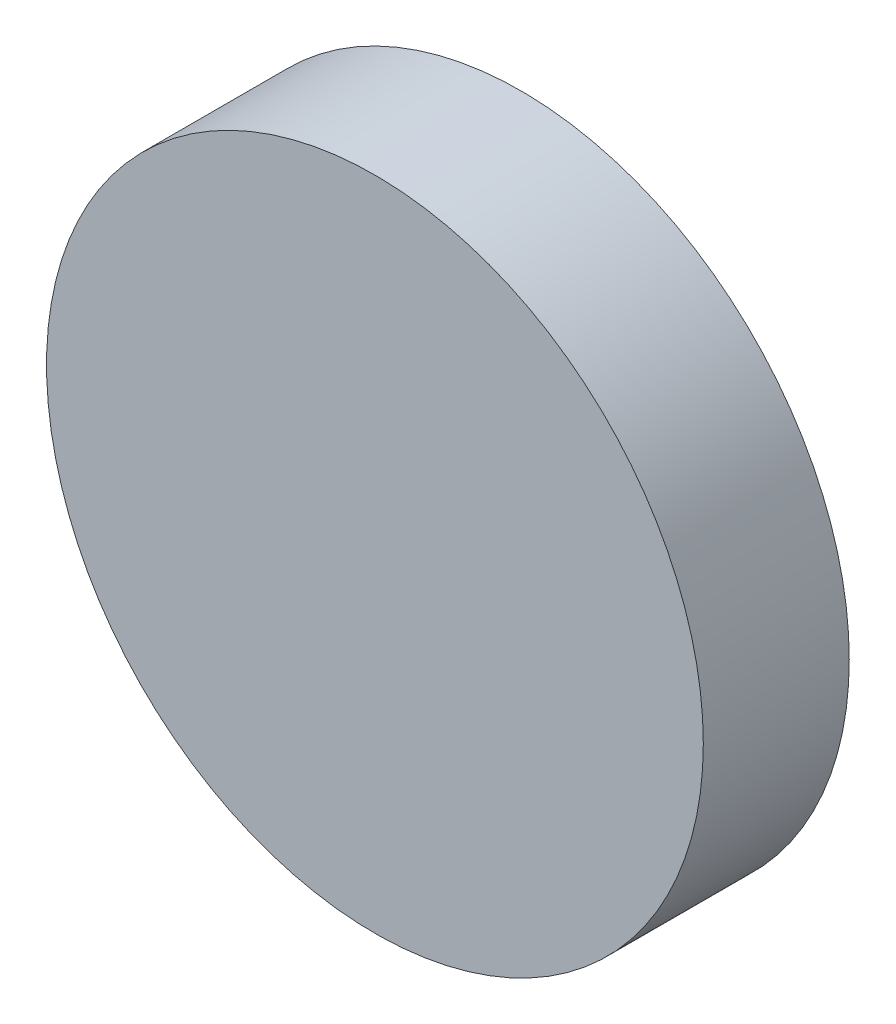
ISO-10303-21;
HEADER;
FILE_DESCRIPTION(('STEP AP214'),'2;1');
FILE_NAME('part.step','',(''),(''),'','','');
FILE_SCHEMA(('AUTOMOTIVE_DESIGN { 1 0 10303 214 1 1 1 1 }'));
ENDSEC;
DATA;
#1=APPLICATION_CONTEXT('core data for automotive mechanical design processes');
#2=APPLICATION_PROTOCOL_DEFINITION('international standard','automotive_design',2000,#1);
#3=PRODUCT_CONTEXT('',#1,'mechanical');
#4=PRODUCT('Part','Part','',(#3));
#5=PRODUCT_RELATED_PRODUCT_CATEGORY('part','',(#4));
#6=PRODUCT_DEFINITION_FORMATION('','',#4);
#7=PRODUCT_DEFINITION_CONTEXT('part definition',#1,'design');
#8=PRODUCT_DEFINITION('design','',#6,#7);
#9=PRODUCT_DEFINITION_SHAPE('','',#8);
#10=(LENGTH_UNIT() NAMED_UNIT(*) SI_UNIT(.MILLI.,.METRE.));
#11=(NAMED_UNIT(*) PLANE_ANGLE_UNIT() SI_UNIT($,.RADIAN.));
#12=(NAMED_UNIT(*) SI_UNIT($,.STERADIAN.) SOLID_ANGLE_UNIT());
#13=UNCERTAINTY_MEASURE_WITH_UNIT(LENGTH_MEASURE(1.E-05),#10,'distance_accuracy_value','');
#14=(GEOMETRIC_REPRESENTATION_CONTEXT(3) GLOBAL_UNCERTAINTY_ASSIGNED_CONTEXT((#13)) GLOBAL_UNIT_ASSIGNED_CONTEXT((#10,
#11,#12)) REPRESENTATION_CONTEXT('',''));
#15=CARTESIAN_POINT('',(0.,0.,0.));
#16=DIRECTION('',(0.,0.,1.));
#17=DIRECTION('',(1.,0.,0.));
#18=AXIS2_PLACEMENT_3D('',#15,#16,#17);
#19=CARTESIAN_POINT('',(0.,0.,5.08));
#20=DIRECTION('',(0.,0.,-1.));
#21=DIRECTION('',(-1.,0.,0.));
#22=AXIS2_PLACEMENT_3D('',#19,#20,#21);
#23=CYLINDRICAL_SURFACE('',#22,11.43);
#24=CARTESIAN_POINT('',(0.,0.,5.08));
#25=DIRECTION('',(0.,0.,1.));
#26=DIRECTION('',(1.,0.,0.));
#27=AXIS2_PLACEMENT_3D('',#24,#25,#26);
#28=CIRCLE('',#27,11.43);
#29=CARTESIAN_POINT('',(11.43,0.,5.08));
#30=VERTEX_POINT('',#29);
#31=EDGE_CURVE('E10',#30,#30,#28,.T.);
#32=ORIENTED_EDGE('',*,*,#31,.F.);
#33=EDGE_LOOP('',(#32));
#34=FACE_BOUND('',#33,.T.);
#35=CARTESIAN_POINT('',(0.,0.,0.));
#36=DIRECTION('',(0.,0.,1.));
#37=DIRECTION('',(1.,0.,0.));
#38=AXIS2_PLACEMENT_3D('',#35,#36,#37);
#39=CIRCLE('',#38,11.43);
#40=CARTESIAN_POINT('',(11.43,0.,0.));
#41=VERTEX_POINT('',#40);
#42=EDGE_CURVE('E40',#41,#41,#39,.T.);
#43=ORIENTED_EDGE('',*,*,#42,.T.);
#44=EDGE_LOOP('',(#43));
#45=FACE_BOUND('',#44,.T.);
#46=ADVANCED_FACE('F37',(#34,#45),#23,.T.);
#47=CARTESIAN_POINT('',(0.,0.,5.08));
#48=DIRECTION('',(0.,0.,1.));
#49=DIRECTION('',(1.,0.,0.));
#50=AXIS2_PLACEMENT_3D('',#47,#48,#49);
#51=PLANE('',#50);
#52=ORIENTED_EDGE('',*,*,#31,.T.);
#53=EDGE_LOOP('',(#52));
#54=FACE_BOUND('',#53,.T.);
#55=ADVANCED_FACE('F54',(#54),#51,.T.);
#56=CARTESIAN_POINT('',(0.,0.,0.));
#57=DIRECTION('',(0.,0.,1.));
#58=DIRECTION('',(1.,0.,0.));
#59=AXIS2_PLACEMENT_3D('',#56,#57,#58);
#60=PLANE('',#59);
#61=ORIENTED_EDGE('',*,*,#42,.F.);
#62=EDGE_LOOP('',(#61));
#63=FACE_BOUND('',#62,.T.);
#64=ADVANCED_FACE('F52',(#63),#60,.F.);
#65=CLOSED_SHELL('',(#46,#55,#64));
#66=MANIFOLD_SOLID_BREP('B2',#65);
#67=ADVANCED_BREP_SHAPE_REPRESENTATION('',(#18,#66),#14);
#68=SHAPE_DEFINITION_REPRESENTATION(#9,#67);
ENDSEC;
END-ISO-10303-21;
